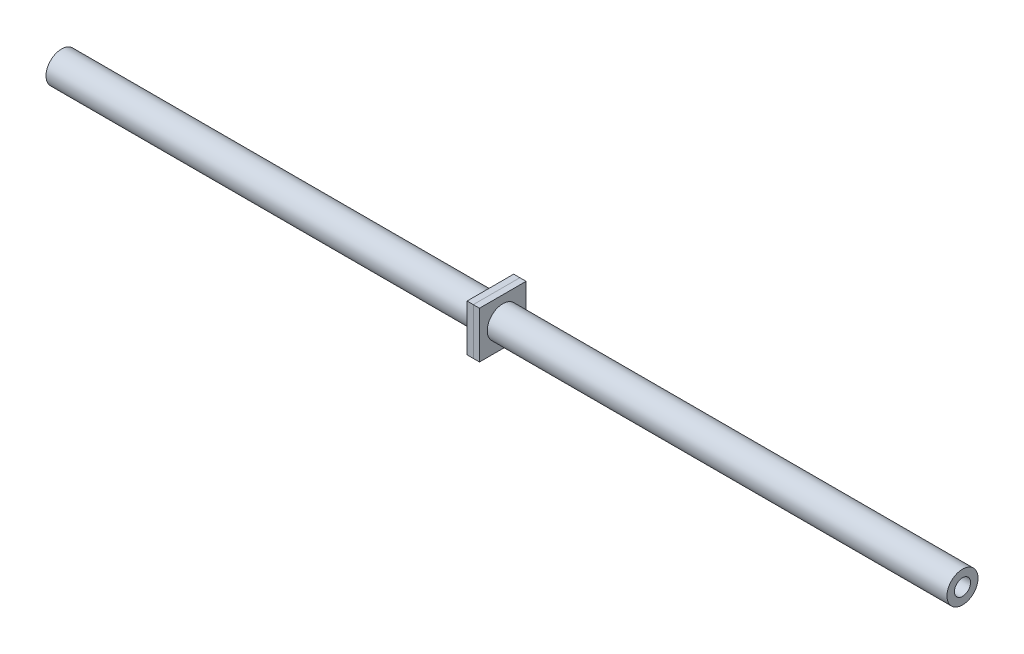
ISO-10303-21;
HEADER;
FILE_DESCRIPTION(('STEP AP214'),'2;1');
FILE_NAME('part.step','',(''),(''),'','','');
FILE_SCHEMA(('AUTOMOTIVE_DESIGN { 1 0 10303 214 1 1 1 1 }'));
ENDSEC;
DATA;
#1=APPLICATION_CONTEXT('core data for automotive mechanical design processes');
#2=APPLICATION_PROTOCOL_DEFINITION('international standard','automotive_design',2000,#1);
#3=PRODUCT_CONTEXT('',#1,'mechanical');
#4=PRODUCT('Part','Part','',(#3));
#5=PRODUCT_RELATED_PRODUCT_CATEGORY('part','',(#4));
#6=PRODUCT_DEFINITION_FORMATION('','',#4);
#7=PRODUCT_DEFINITION_CONTEXT('part definition',#1,'design');
#8=PRODUCT_DEFINITION('design','',#6,#7);
#9=PRODUCT_DEFINITION_SHAPE('','',#8);
#10=(LENGTH_UNIT() NAMED_UNIT(*) SI_UNIT(.MILLI.,.METRE.));
#11=(NAMED_UNIT(*) PLANE_ANGLE_UNIT() SI_UNIT($,.RADIAN.));
#12=(NAMED_UNIT(*) SI_UNIT($,.STERADIAN.) SOLID_ANGLE_UNIT());
#13=UNCERTAINTY_MEASURE_WITH_UNIT(LENGTH_MEASURE(1.E-05),#10,'distance_accuracy_value','');
#14=(GEOMETRIC_REPRESENTATION_CONTEXT(3) GLOBAL_UNCERTAINTY_ASSIGNED_CONTEXT((#13)) GLOBAL_UNIT_ASSIGNED_CONTEXT((#10,
#11,#12)) REPRESENTATION_CONTEXT('',''));
#15=CARTESIAN_POINT('',(0.,0.,0.));
#16=DIRECTION('',(0.,0.,1.));
#17=DIRECTION('',(1.,0.,0.));
#18=AXIS2_PLACEMENT_3D('',#15,#16,#17);
#19=CARTESIAN_POINT('',(175.26,0.,0.));
#20=DIRECTION('',(1.,0.,0.));
#21=DIRECTION('',(0.,0.,-1.));
#22=AXIS2_PLACEMENT_3D('',#19,#20,#21);
#23=PLANE('',#22);
#24=DIRECTION('',(0.,1.,0.));
#25=VECTOR('',#24,1.);
#26=CARTESIAN_POINT('',(175.26,0.,-9.525));
#27=LINE('',#26,#25);
#28=CARTESIAN_POINT('',(175.26,-9.525,-9.525));
#29=VERTEX_POINT('',#28);
#30=CARTESIAN_POINT('',(175.26,9.525,-9.525));
#31=VERTEX_POINT('',#30);
#32=EDGE_CURVE('E114',#29,#31,#27,.T.);
#33=ORIENTED_EDGE('',*,*,#32,.F.);
#34=DIRECTION('',(0.,0.,-1.));
#35=VECTOR('',#34,1.);
#36=CARTESIAN_POINT('',(175.26,-9.525,0.));
#37=LINE('',#36,#35);
#38=CARTESIAN_POINT('',(175.26,-9.525,9.525));
#39=VERTEX_POINT('',#38);
#40=EDGE_CURVE('E111',#39,#29,#37,.T.);
#41=ORIENTED_EDGE('',*,*,#40,.F.);
#42=DIRECTION('',(0.,-1.,0.));
#43=VECTOR('',#42,1.);
#44=CARTESIAN_POINT('',(175.26,0.,9.525));
#45=LINE('',#44,#43);
#46=CARTESIAN_POINT('',(175.26,9.525,9.525));
#47=VERTEX_POINT('',#46);
#48=EDGE_CURVE('E104',#47,#39,#45,.T.);
#49=ORIENTED_EDGE('',*,*,#48,.F.);
#50=DIRECTION('',(0.,0.,1.));
#51=VECTOR('',#50,1.);
#52=CARTESIAN_POINT('',(175.26,9.525,0.));
#53=LINE('',#52,#51);
#54=EDGE_CURVE('E110',#31,#47,#53,.T.);
#55=ORIENTED_EDGE('',*,*,#54,.F.);
#56=EDGE_LOOP('',(#33,#41,#49,#55));
#57=FACE_BOUND('',#56,.T.);
#58=CARTESIAN_POINT('',(175.26,0.,0.));
#59=DIRECTION('',(-1.,0.,0.));
#60=DIRECTION('',(0.,0.,1.));
#61=AXIS2_PLACEMENT_3D('',#58,#59,#60);
#62=CIRCLE('',#61,6.35);
#63=CARTESIAN_POINT('',(175.26,0.,6.35));
#64=VERTEX_POINT('',#63);
#65=EDGE_CURVE('E125',#64,#64,#62,.T.);
#66=ORIENTED_EDGE('',*,*,#65,.F.);
#67=EDGE_LOOP('',(#66));
#68=FACE_BOUND('',#67,.T.);
#69=ADVANCED_FACE('F55',(#57,#68),#23,.F.);
#70=CARTESIAN_POINT('',(177.8,0.,0.));
#71=DIRECTION('',(1.,0.,0.));
#72=DIRECTION('',(0.,0.,-1.));
#73=AXIS2_PLACEMENT_3D('',#70,#71,#72);
#74=PLANE('',#73);
#75=DIRECTION('',(0.,1.,0.));
#76=VECTOR('',#75,1.);
#77=CARTESIAN_POINT('',(177.8,0.,-9.525));
#78=LINE('',#77,#76);
#79=CARTESIAN_POINT('',(177.8,-9.525,-9.525));
#80=VERTEX_POINT('',#79);
#81=CARTESIAN_POINT('',(177.8,9.525,-9.525));
#82=VERTEX_POINT('',#81);
#83=EDGE_CURVE('E121',#80,#82,#78,.T.);
#84=ORIENTED_EDGE('',*,*,#83,.T.);
#85=DIRECTION('',(0.,0.,1.));
#86=VECTOR('',#85,1.);
#87=CARTESIAN_POINT('',(177.8,9.525,0.));
#88=LINE('',#87,#86);
#89=CARTESIAN_POINT('',(177.8,9.525,9.525));
#90=VERTEX_POINT('',#89);
#91=EDGE_CURVE('E124',#82,#90,#88,.T.);
#92=ORIENTED_EDGE('',*,*,#91,.T.);
#93=DIRECTION('',(0.,-1.,0.));
#94=VECTOR('',#93,1.);
#95=CARTESIAN_POINT('',(177.8,0.,9.525));
#96=LINE('',#95,#94);
#97=CARTESIAN_POINT('',(177.8,-9.525,9.525));
#98=VERTEX_POINT('',#97);
#99=EDGE_CURVE('E106',#90,#98,#96,.T.);
#100=ORIENTED_EDGE('',*,*,#99,.T.);
#101=DIRECTION('',(0.,0.,-1.));
#102=VECTOR('',#101,1.);
#103=CARTESIAN_POINT('',(177.8,-9.525,0.));
#104=LINE('',#103,#102);
#105=EDGE_CURVE('E116',#98,#80,#104,.T.);
#106=ORIENTED_EDGE('',*,*,#105,.T.);
#107=EDGE_LOOP('',(#84,#92,#100,#106));
#108=FACE_BOUND('',#107,.T.);
#109=CARTESIAN_POINT('',(177.8,0.,0.));
#110=DIRECTION('',(-1.,0.,0.));
#111=DIRECTION('',(0.,0.,1.));
#112=AXIS2_PLACEMENT_3D('',#109,#110,#111);
#113=CIRCLE('',#112,6.35);
#114=CARTESIAN_POINT('',(177.8,0.,6.35));
#115=VERTEX_POINT('',#114);
#116=EDGE_CURVE('E159',#115,#115,#113,.T.);
#117=ORIENTED_EDGE('',*,*,#116,.T.);
#118=EDGE_LOOP('',(#117));
#119=FACE_BOUND('',#118,.T.);
#120=ADVANCED_FACE('F131',(#108,#119),#74,.T.);
#121=CARTESIAN_POINT('',(175.26,0.,-9.525));
#122=DIRECTION('',(0.,0.,-1.));
#123=DIRECTION('',(0.,1.,0.));
#124=AXIS2_PLACEMENT_3D('',#121,#122,#123);
#125=PLANE('',#124);
#126=ORIENTED_EDGE('',*,*,#83,.F.);
#127=DIRECTION('',(1.,0.,0.));
#128=VECTOR('',#127,1.);
#129=CARTESIAN_POINT('',(175.26,-9.525,-9.525));
#130=LINE('',#129,#128);
#131=EDGE_CURVE('E13',#29,#80,#130,.T.);
#132=ORIENTED_EDGE('',*,*,#131,.F.);
#133=ORIENTED_EDGE('',*,*,#32,.T.);
#134=DIRECTION('',(1.,0.,0.));
#135=VECTOR('',#134,1.);
#136=CARTESIAN_POINT('',(175.26,9.525,-9.525));
#137=LINE('',#136,#135);
#138=EDGE_CURVE('E59',#31,#82,#137,.T.);
#139=ORIENTED_EDGE('',*,*,#138,.T.);
#140=EDGE_LOOP('',(#126,#132,#133,#139));
#141=FACE_BOUND('',#140,.T.);
#142=ADVANCED_FACE('F57',(#141),#125,.T.);
#143=CARTESIAN_POINT('',(175.26,-9.525,0.));
#144=DIRECTION('',(0.,-1.,0.));
#145=DIRECTION('',(0.,0.,-1.));
#146=AXIS2_PLACEMENT_3D('',#143,#144,#145);
#147=PLANE('',#146);
#148=ORIENTED_EDGE('',*,*,#105,.F.);
#149=DIRECTION('',(1.,0.,0.));
#150=VECTOR('',#149,1.);
#151=CARTESIAN_POINT('',(175.26,-9.525,9.525));
#152=LINE('',#151,#150);
#153=EDGE_CURVE('E65',#39,#98,#152,.T.);
#154=ORIENTED_EDGE('',*,*,#153,.F.);
#155=ORIENTED_EDGE('',*,*,#40,.T.);
#156=ORIENTED_EDGE('',*,*,#131,.T.);
#157=EDGE_LOOP('',(#148,#154,#155,#156));
#158=FACE_BOUND('',#157,.T.);
#159=ADVANCED_FACE('F133',(#158),#147,.T.);
#160=CARTESIAN_POINT('',(175.26,0.,9.525));
#161=DIRECTION('',(0.,0.,1.));
#162=DIRECTION('',(0.,-1.,0.));
#163=AXIS2_PLACEMENT_3D('',#160,#161,#162);
#164=PLANE('',#163);
#165=ORIENTED_EDGE('',*,*,#99,.F.);
#166=DIRECTION('',(1.,0.,0.));
#167=VECTOR('',#166,1.);
#168=CARTESIAN_POINT('',(175.26,9.525,9.525));
#169=LINE('',#168,#167);
#170=EDGE_CURVE('E101',#47,#90,#169,.T.);
#171=ORIENTED_EDGE('',*,*,#170,.F.);
#172=ORIENTED_EDGE('',*,*,#48,.T.);
#173=ORIENTED_EDGE('',*,*,#153,.T.);
#174=EDGE_LOOP('',(#165,#171,#172,#173));
#175=FACE_BOUND('',#174,.T.);
#176=ADVANCED_FACE('F103',(#175),#164,.T.);
#177=CARTESIAN_POINT('',(175.26,9.525,0.));
#178=DIRECTION('',(0.,1.,0.));
#179=DIRECTION('',(0.,0.,1.));
#180=AXIS2_PLACEMENT_3D('',#177,#178,#179);
#181=PLANE('',#180);
#182=ORIENTED_EDGE('',*,*,#91,.F.);
#183=ORIENTED_EDGE('',*,*,#138,.F.);
#184=ORIENTED_EDGE('',*,*,#54,.T.);
#185=ORIENTED_EDGE('',*,*,#170,.T.);
#186=EDGE_LOOP('',(#182,#183,#184,#185));
#187=FACE_BOUND('',#186,.T.);
#188=ADVANCED_FACE('F113',(#187),#181,.T.);
#189=CARTESIAN_POINT('',(175.26,0.,0.));
#190=DIRECTION('',(1.,0.,0.));
#191=DIRECTION('',(0.,0.,-1.));
#192=AXIS2_PLACEMENT_3D('',#189,#190,#191);
#193=CYLINDRICAL_SURFACE('',#192,6.35);
#194=ORIENTED_EDGE('',*,*,#65,.T.);
#195=EDGE_LOOP('',(#194));
#196=FACE_BOUND('',#195,.T.);
#197=ORIENTED_EDGE('',*,*,#116,.F.);
#198=EDGE_LOOP('',(#197));
#199=FACE_BOUND('',#198,.T.);
#200=ADVANCED_FACE('F148',(#196,#199),#193,.F.);
#201=CLOSED_SHELL('',(#69,#120,#142,#159,#176,#188,#200));
#202=MANIFOLD_SOLID_BREP('B2',#201);
#203=CARTESIAN_POINT('',(180.34,0.,0.));
#204=DIRECTION('',(-1.,0.,0.));
#205=DIRECTION('',(0.,0.,1.));
#206=AXIS2_PLACEMENT_3D('',#203,#204,#205);
#207=PLANE('',#206);
#208=DIRECTION('',(0.,-1.,0.));
#209=VECTOR('',#208,1.);
#210=CARTESIAN_POINT('',(180.34,9.525,9.525));
#211=LINE('',#210,#209);
#212=CARTESIAN_POINT('',(180.34,9.525,9.525));
#213=VERTEX_POINT('',#212);
#214=CARTESIAN_POINT('',(180.34,-9.525,9.525));
#215=VERTEX_POINT('',#214);
#216=EDGE_CURVE('E259',#213,#215,#211,.T.);
#217=ORIENTED_EDGE('',*,*,#216,.T.);
#218=DIRECTION('',(0.,0.,-1.));
#219=VECTOR('',#218,1.);
#220=CARTESIAN_POINT('',(180.34,-9.525,-9.525));
#221=LINE('',#220,#219);
#222=CARTESIAN_POINT('',(180.34,-9.525,-9.525));
#223=VERTEX_POINT('',#222);
#224=EDGE_CURVE('E254',#215,#223,#221,.T.);
#225=ORIENTED_EDGE('',*,*,#224,.T.);
#226=DIRECTION('',(0.,1.,0.));
#227=VECTOR('',#226,1.);
#228=CARTESIAN_POINT('',(180.34,9.525,-9.525));
#229=LINE('',#228,#227);
#230=CARTESIAN_POINT('',(180.34,9.525,-9.525));
#231=VERTEX_POINT('',#230);
#232=EDGE_CURVE('E257',#223,#231,#229,.T.);
#233=ORIENTED_EDGE('',*,*,#232,.T.);
#234=DIRECTION('',(0.,0.,1.));
#235=VECTOR('',#234,1.);
#236=CARTESIAN_POINT('',(180.34,9.525,-9.525));
#237=LINE('',#236,#235);
#238=EDGE_CURVE('E224',#231,#213,#237,.T.);
#239=ORIENTED_EDGE('',*,*,#238,.T.);
#240=EDGE_LOOP('',(#217,#225,#233,#239));
#241=FACE_BOUND('',#240,.T.);
#242=CARTESIAN_POINT('',(180.34,0.,0.));
#243=DIRECTION('',(1.,0.,0.));
#244=DIRECTION('',(0.,0.,-1.));
#245=AXIS2_PLACEMENT_3D('',#242,#243,#244);
#246=CIRCLE('',#245,6.35);
#247=CARTESIAN_POINT('',(180.34,0.,-6.35));
#248=VERTEX_POINT('',#247);
#249=EDGE_CURVE('E274',#248,#248,#246,.T.);
#250=ORIENTED_EDGE('',*,*,#249,.F.);
#251=EDGE_LOOP('',(#250));
#252=FACE_BOUND('',#251,.T.);
#253=ADVANCED_FACE('F207',(#241,#252),#207,.F.);
#254=CARTESIAN_POINT('',(177.8,0.,0.));
#255=DIRECTION('',(-1.,0.,0.));
#256=DIRECTION('',(0.,0.,1.));
#257=AXIS2_PLACEMENT_3D('',#254,#255,#256);
#258=PLANE('',#257);
#259=DIRECTION('',(0.,-1.,0.));
#260=VECTOR('',#259,1.);
#261=CARTESIAN_POINT('',(177.8,9.525,9.525));
#262=LINE('',#261,#260);
#263=CARTESIAN_POINT('',(177.8,9.525,9.525));
#264=VERTEX_POINT('',#263);
#265=CARTESIAN_POINT('',(177.8,-9.525,9.525));
#266=VERTEX_POINT('',#265);
#267=EDGE_CURVE('E271',#264,#266,#262,.T.);
#268=ORIENTED_EDGE('',*,*,#267,.F.);
#269=DIRECTION('',(0.,0.,1.));
#270=VECTOR('',#269,1.);
#271=CARTESIAN_POINT('',(177.8,9.525,-9.525));
#272=LINE('',#271,#270);
#273=CARTESIAN_POINT('',(177.8,9.525,-9.525));
#274=VERTEX_POINT('',#273);
#275=EDGE_CURVE('E247',#274,#264,#272,.T.);
#276=ORIENTED_EDGE('',*,*,#275,.F.);
#277=DIRECTION('',(0.,1.,0.));
#278=VECTOR('',#277,1.);
#279=CARTESIAN_POINT('',(177.8,9.525,-9.525));
#280=LINE('',#279,#278);
#281=CARTESIAN_POINT('',(177.8,-9.525,-9.525));
#282=VERTEX_POINT('',#281);
#283=EDGE_CURVE('E241',#282,#274,#280,.T.);
#284=ORIENTED_EDGE('',*,*,#283,.F.);
#285=DIRECTION('',(0.,0.,-1.));
#286=VECTOR('',#285,1.);
#287=CARTESIAN_POINT('',(177.8,-9.525,-9.525));
#288=LINE('',#287,#286);
#289=EDGE_CURVE('E263',#266,#282,#288,.T.);
#290=ORIENTED_EDGE('',*,*,#289,.F.);
#291=EDGE_LOOP('',(#268,#276,#284,#290));
#292=FACE_BOUND('',#291,.T.);
#293=CARTESIAN_POINT('',(177.8,0.,0.));
#294=DIRECTION('',(1.,0.,0.));
#295=DIRECTION('',(0.,0.,-1.));
#296=AXIS2_PLACEMENT_3D('',#293,#294,#295);
#297=CIRCLE('',#296,6.35);
#298=CARTESIAN_POINT('',(177.8,0.,-6.35));
#299=VERTEX_POINT('',#298);
#300=EDGE_CURVE('E286',#299,#299,#297,.T.);
#301=ORIENTED_EDGE('',*,*,#300,.T.);
#302=EDGE_LOOP('',(#301));
#303=FACE_BOUND('',#302,.T.);
#304=ADVANCED_FACE('F282',(#292,#303),#258,.T.);
#305=CARTESIAN_POINT('',(180.34,9.525,9.525));
#306=DIRECTION('',(0.,0.,-1.));
#307=DIRECTION('',(0.,1.,0.));
#308=AXIS2_PLACEMENT_3D('',#305,#306,#307);
#309=PLANE('',#308);
#310=ORIENTED_EDGE('',*,*,#267,.T.);
#311=DIRECTION('',(-1.,0.,0.));
#312=VECTOR('',#311,1.);
#313=CARTESIAN_POINT('',(180.34,-9.525,9.525));
#314=LINE('',#313,#312);
#315=EDGE_CURVE('E53',#215,#266,#314,.T.);
#316=ORIENTED_EDGE('',*,*,#315,.F.);
#317=ORIENTED_EDGE('',*,*,#216,.F.);
#318=DIRECTION('',(-1.,0.,0.));
#319=VECTOR('',#318,1.);
#320=CARTESIAN_POINT('',(180.34,9.525,9.525));
#321=LINE('',#320,#319);
#322=EDGE_CURVE('E267',#213,#264,#321,.T.);
#323=ORIENTED_EDGE('',*,*,#322,.T.);
#324=EDGE_LOOP('',(#310,#316,#317,#323));
#325=FACE_BOUND('',#324,.T.);
#326=ADVANCED_FACE('F209',(#325),#309,.F.);
#327=CARTESIAN_POINT('',(180.34,-9.525,-9.525));
#328=DIRECTION('',(0.,1.,0.));
#329=DIRECTION('',(0.,0.,1.));
#330=AXIS2_PLACEMENT_3D('',#327,#328,#329);
#331=PLANE('',#330);
#332=ORIENTED_EDGE('',*,*,#289,.T.);
#333=DIRECTION('',(-1.,0.,0.));
#334=VECTOR('',#333,1.);
#335=CARTESIAN_POINT('',(180.34,-9.525,-9.525));
#336=LINE('',#335,#334);
#337=EDGE_CURVE('E216',#223,#282,#336,.T.);
#338=ORIENTED_EDGE('',*,*,#337,.F.);
#339=ORIENTED_EDGE('',*,*,#224,.F.);
#340=ORIENTED_EDGE('',*,*,#315,.T.);
#341=EDGE_LOOP('',(#332,#338,#339,#340));
#342=FACE_BOUND('',#341,.T.);
#343=ADVANCED_FACE('F262',(#342),#331,.F.);
#344=CARTESIAN_POINT('',(180.34,9.525,-9.525));
#345=DIRECTION('',(0.,0.,1.));
#346=DIRECTION('',(0.,-1.,0.));
#347=AXIS2_PLACEMENT_3D('',#344,#345,#346);
#348=PLANE('',#347);
#349=ORIENTED_EDGE('',*,*,#283,.T.);
#350=DIRECTION('',(-1.,0.,0.));
#351=VECTOR('',#350,1.);
#352=CARTESIAN_POINT('',(180.34,9.525,-9.525));
#353=LINE('',#352,#351);
#354=EDGE_CURVE('E264',#231,#274,#353,.T.);
#355=ORIENTED_EDGE('',*,*,#354,.F.);
#356=ORIENTED_EDGE('',*,*,#232,.F.);
#357=ORIENTED_EDGE('',*,*,#337,.T.);
#358=EDGE_LOOP('',(#349,#355,#356,#357));
#359=FACE_BOUND('',#358,.T.);
#360=ADVANCED_FACE('F265',(#359),#348,.F.);
#361=CARTESIAN_POINT('',(180.34,9.525,-9.525));
#362=DIRECTION('',(0.,-1.,0.));
#363=DIRECTION('',(0.,0.,-1.));
#364=AXIS2_PLACEMENT_3D('',#361,#362,#363);
#365=PLANE('',#364);
#366=ORIENTED_EDGE('',*,*,#275,.T.);
#367=ORIENTED_EDGE('',*,*,#322,.F.);
#368=ORIENTED_EDGE('',*,*,#238,.F.);
#369=ORIENTED_EDGE('',*,*,#354,.T.);
#370=EDGE_LOOP('',(#366,#367,#368,#369));
#371=FACE_BOUND('',#370,.T.);
#372=ADVANCED_FACE('F279',(#371),#365,.F.);
#373=CARTESIAN_POINT('',(180.34,0.,0.));
#374=DIRECTION('',(-1.,0.,0.));
#375=DIRECTION('',(0.,0.,1.));
#376=AXIS2_PLACEMENT_3D('',#373,#374,#375);
#377=CYLINDRICAL_SURFACE('',#376,6.35);
#378=ORIENTED_EDGE('',*,*,#249,.T.);
#379=EDGE_LOOP('',(#378));
#380=FACE_BOUND('',#379,.T.);
#381=ORIENTED_EDGE('',*,*,#300,.F.);
#382=EDGE_LOOP('',(#381));
#383=FACE_BOUND('',#382,.T.);
#384=ADVANCED_FACE('F292',(#380,#383),#377,.F.);
#385=CLOSED_SHELL('',(#253,#304,#326,#343,#360,#372,#384));
#386=MANIFOLD_SOLID_BREP('B7',#385);
#387=CARTESIAN_POINT('',(368.21482491,0.,0.));
#388=DIRECTION('',(-1.,0.,0.));
#389=DIRECTION('',(0.,0.,1.));
#390=AXIS2_PLACEMENT_3D('',#387,#388,#389);
#391=CYLINDRICAL_SURFACE('',#390,3.302);
#392=CARTESIAN_POINT('',(368.21482491,0.,0.));
#393=DIRECTION('',(1.,0.,0.));
#394=DIRECTION('',(0.,0.,-1.));
#395=AXIS2_PLACEMENT_3D('',#392,#393,#394);
#396=CIRCLE('',#395,3.302);
#397=CARTESIAN_POINT('',(368.21482491,0.,3.302));
#398=VERTEX_POINT('',#397);
#399=EDGE_CURVE('E344',#398,#398,#396,.T.);
#400=CARTESIAN_POINT('',(0.,0.,0.));
#401=DIRECTION('',(1.,0.,0.));
#402=DIRECTION('',(0.,0.,-1.));
#403=AXIS2_PLACEMENT_3D('',#400,#401,#402);
#404=CIRCLE('',#403,3.302);
#405=CARTESIAN_POINT('',(0.,0.,3.302));
#406=VERTEX_POINT('',#405);
#407=EDGE_CURVE('E350',#406,#406,#404,.T.);
#408=CARTESIAN_POINT('',(368.21482491,0.,3.302));
#409=CARTESIAN_POINT('',(364.379253817187,0.,3.302));
#410=CARTESIAN_POINT('',(360.543682724375,0.,3.302));
#411=CARTESIAN_POINT('',(352.87254053875,0.,3.302));
#412=CARTESIAN_POINT('',(349.036969445937,0.,3.302));
#413=CARTESIAN_POINT('',(341.365827260312,0.,3.302));
#414=CARTESIAN_POINT('',(337.5302561675,0.,3.302));
#415=CARTESIAN_POINT('',(329.859113981875,0.,3.302));
#416=CARTESIAN_POINT('',(326.023542889062,0.,3.302));
#417=CARTESIAN_POINT('',(318.352400703437,0.,3.302));
#418=CARTESIAN_POINT('',(314.516829610625,0.,3.302));
#419=CARTESIAN_POINT('',(306.845687425,0.,3.302));
#420=CARTESIAN_POINT('',(303.010116332187,0.,3.302));
#421=CARTESIAN_POINT('',(295.338974146562,0.,3.302));
#422=CARTESIAN_POINT('',(291.50340305375,0.,3.302));
#423=CARTESIAN_POINT('',(283.832260868125,0.,3.302));
#424=CARTESIAN_POINT('',(279.996689775312,0.,3.302));
#425=CARTESIAN_POINT('',(272.325547589687,0.,3.302));
#426=CARTESIAN_POINT('',(268.489976496875,0.,3.302));
#427=CARTESIAN_POINT('',(260.81883431125,0.,3.302));
#428=CARTESIAN_POINT('',(256.983263218437,0.,3.302));
#429=CARTESIAN_POINT('',(249.312121032812,0.,3.302));
#430=CARTESIAN_POINT('',(245.47654994,0.,3.302));
#431=CARTESIAN_POINT('',(237.805407754375,0.,3.302));
#432=CARTESIAN_POINT('',(233.969836661562,0.,3.302));
#433=CARTESIAN_POINT('',(226.298694475937,0.,3.302));
#434=CARTESIAN_POINT('',(222.463123383125,0.,3.302));
#435=CARTESIAN_POINT('',(214.7919811975,0.,3.302));
#436=CARTESIAN_POINT('',(210.956410104687,0.,3.302));
#437=CARTESIAN_POINT('',(203.285267919062,0.,3.302));
#438=CARTESIAN_POINT('',(199.44969682625,0.,3.302));
#439=CARTESIAN_POINT('',(191.778554640625,0.,3.302));
#440=CARTESIAN_POINT('',(187.942983547812,0.,3.302));
#441=CARTESIAN_POINT('',(180.271841362188,0.,3.302));
#442=CARTESIAN_POINT('',(176.436270269375,0.,3.302));
#443=CARTESIAN_POINT('',(168.76512808375,0.,3.302));
#444=CARTESIAN_POINT('',(164.929556990937,0.,3.302));
#445=CARTESIAN_POINT('',(157.258414805312,0.,3.302));
#446=CARTESIAN_POINT('',(153.4228437125,0.,3.302));
#447=CARTESIAN_POINT('',(145.751701526875,0.,3.302));
#448=CARTESIAN_POINT('',(141.916130434062,0.,3.302));
#449=CARTESIAN_POINT('',(134.244988248437,0.,3.302));
#450=CARTESIAN_POINT('',(130.409417155625,0.,3.302));
#451=CARTESIAN_POINT('',(122.73827497,0.,3.302));
#452=CARTESIAN_POINT('',(118.902703877187,0.,3.302));
#453=CARTESIAN_POINT('',(111.231561691562,0.,3.302));
#454=CARTESIAN_POINT('',(107.39599059875,0.,3.302));
#455=CARTESIAN_POINT('',(99.724848413125,0.,3.302));
#456=CARTESIAN_POINT('',(95.8892773203125,0.,3.302));
#457=CARTESIAN_POINT('',(88.2181351346875,0.,3.302));
#458=CARTESIAN_POINT('',(84.382564041875,0.,3.302));
#459=CARTESIAN_POINT('',(76.71142185625,0.,3.302));
#460=CARTESIAN_POINT('',(72.8758507634375,0.,3.302));
#461=CARTESIAN_POINT('',(65.2047085778125,0.,3.302));
#462=CARTESIAN_POINT('',(61.369137485,0.,3.302));
#463=CARTESIAN_POINT('',(53.697995299375,0.,3.302));
#464=CARTESIAN_POINT('',(49.8624242065625,0.,3.302));
#465=CARTESIAN_POINT('',(42.1912820209375,0.,3.302));
#466=CARTESIAN_POINT('',(38.355710928125,0.,3.302));
#467=CARTESIAN_POINT('',(30.6845687425,0.,3.302));
#468=CARTESIAN_POINT('',(26.8489976496875,0.,3.302));
#469=CARTESIAN_POINT('',(19.1778554640625,0.,3.302));
#470=CARTESIAN_POINT('',(15.34228437125,0.,3.302));
#471=CARTESIAN_POINT('',(7.671142185625,0.,3.302));
#472=CARTESIAN_POINT('',(3.8355710928125,0.,3.302));
#473=CARTESIAN_POINT('',(0.,0.,3.302));
#474=B_SPLINE_CURVE_WITH_KNOTS('',3,(#408,#409,#410,#411,#412,#413,#414,#415,#416,#417,#418,
#419,#420,#421,#422,#423,#424,#425,#426,#427,#428,#429,#430,#431,#432,#433,#434,#435,#436,#437,
#438,#439,#440,#441,#442,#443,#444,#445,#446,#447,#448,#449,#450,#451,#452,#453,#454,#455,#456,
#457,#458,#459,#460,#461,#462,#463,#464,#465,#466,#467,#468,#469,#470,#471,#472,#473),
.UNSPECIFIED.,.F.,.F.,(4,2,2,2,2,2,2,2,2,2,2,2,2,2,2,2,2,2,2,2,2,2,2,2,2,2,2,2,2,2,2,2,4),(0.,
11.5067132784374,23.013426556875,34.5201398353124,46.02685311375,57.5335663921874,
69.040279670625,80.5469929490624,92.0537062275,103.560419505937,115.067132784375,
126.573846062812,138.08055934125,149.587272619687,161.093985898125,172.600699176562,
184.107412455,195.614125733437,207.120839011875,218.627552290312,230.13426556875,
241.640978847187,253.147692125625,264.654405404062,276.1611186825,287.667831960937,
299.174545239375,310.681258517812,322.18797179625,333.694685074687,345.201398353125,
356.708111631562,368.21482491),.UNSPECIFIED.);
#475=EDGE_CURVE('BSEAM337',#398,#406,#474,.T.);
#476=ORIENTED_EDGE('',*,*,#399,.T.);
#477=ORIENTED_EDGE('',*,*,#407,.F.);
#478=ORIENTED_EDGE('',*,*,#475,.T.);
#479=ORIENTED_EDGE('',*,*,#475,.F.);
#480=EDGE_LOOP('',(#476,#478,#477,#479));
#481=FACE_BOUND('',#480,.T.);
#482=ADVANCED_FACE('F337',(#481),#391,.F.);
#483=CARTESIAN_POINT('',(368.21482491,0.,0.));
#484=DIRECTION('',(-1.,0.,0.));
#485=DIRECTION('',(0.,0.,1.));
#486=AXIS2_PLACEMENT_3D('',#483,#484,#485);
#487=CYLINDRICAL_SURFACE('',#486,6.35);
#488=CARTESIAN_POINT('',(368.21482491,0.,0.));
#489=DIRECTION('',(1.,0.,0.));
#490=DIRECTION('',(0.,0.,-1.));
#491=AXIS2_PLACEMENT_3D('',#488,#489,#490);
#492=CIRCLE('',#491,6.35);
#493=CARTESIAN_POINT('',(368.21482491,0.,6.35));
#494=VERTEX_POINT('',#493);
#495=EDGE_CURVE('E206',#494,#494,#492,.T.);
#496=CARTESIAN_POINT('',(0.,0.,0.));
#497=DIRECTION('',(1.,0.,0.));
#498=DIRECTION('',(0.,0.,-1.));
#499=AXIS2_PLACEMENT_3D('',#496,#497,#498);
#500=CIRCLE('',#499,6.35);
#501=CARTESIAN_POINT('',(0.,0.,6.35));
#502=VERTEX_POINT('',#501);
#503=EDGE_CURVE('E340',#502,#502,#500,.T.);
#504=CARTESIAN_POINT('',(368.21482491,0.,6.35));
#505=CARTESIAN_POINT('',(364.379253817187,0.,6.35));
#506=CARTESIAN_POINT('',(360.543682724375,0.,6.35));
#507=CARTESIAN_POINT('',(352.87254053875,0.,6.35));
#508=CARTESIAN_POINT('',(349.036969445937,0.,6.35));
#509=CARTESIAN_POINT('',(341.365827260312,0.,6.35));
#510=CARTESIAN_POINT('',(337.5302561675,0.,6.35));
#511=CARTESIAN_POINT('',(329.859113981875,0.,6.35));
#512=CARTESIAN_POINT('',(326.023542889062,0.,6.35));
#513=CARTESIAN_POINT('',(318.352400703437,0.,6.35));
#514=CARTESIAN_POINT('',(314.516829610625,0.,6.35));
#515=CARTESIAN_POINT('',(306.845687425,0.,6.35));
#516=CARTESIAN_POINT('',(303.010116332187,0.,6.35));
#517=CARTESIAN_POINT('',(295.338974146562,0.,6.35));
#518=CARTESIAN_POINT('',(291.50340305375,0.,6.35));
#519=CARTESIAN_POINT('',(283.832260868125,0.,6.35));
#520=CARTESIAN_POINT('',(279.996689775312,0.,6.35));
#521=CARTESIAN_POINT('',(272.325547589687,0.,6.35));
#522=CARTESIAN_POINT('',(268.489976496875,0.,6.35));
#523=CARTESIAN_POINT('',(260.81883431125,0.,6.35));
#524=CARTESIAN_POINT('',(256.983263218437,0.,6.35));
#525=CARTESIAN_POINT('',(249.312121032812,0.,6.35));
#526=CARTESIAN_POINT('',(245.47654994,0.,6.35));
#527=CARTESIAN_POINT('',(237.805407754375,0.,6.35));
#528=CARTESIAN_POINT('',(233.969836661562,0.,6.35));
#529=CARTESIAN_POINT('',(226.298694475937,0.,6.35));
#530=CARTESIAN_POINT('',(222.463123383125,0.,6.35));
#531=CARTESIAN_POINT('',(214.7919811975,0.,6.35));
#532=CARTESIAN_POINT('',(210.956410104687,0.,6.35));
#533=CARTESIAN_POINT('',(203.285267919062,0.,6.35));
#534=CARTESIAN_POINT('',(199.44969682625,0.,6.35));
#535=CARTESIAN_POINT('',(191.778554640625,0.,6.35));
#536=CARTESIAN_POINT('',(187.942983547812,0.,6.35));
#537=CARTESIAN_POINT('',(180.271841362188,0.,6.35));
#538=CARTESIAN_POINT('',(176.436270269375,0.,6.35));
#539=CARTESIAN_POINT('',(168.76512808375,0.,6.35));
#540=CARTESIAN_POINT('',(164.929556990937,0.,6.35));
#541=CARTESIAN_POINT('',(157.258414805312,0.,6.35));
#542=CARTESIAN_POINT('',(153.4228437125,0.,6.35));
#543=CARTESIAN_POINT('',(145.751701526875,0.,6.35));
#544=CARTESIAN_POINT('',(141.916130434062,0.,6.35));
#545=CARTESIAN_POINT('',(134.244988248437,0.,6.35));
#546=CARTESIAN_POINT('',(130.409417155625,0.,6.35));
#547=CARTESIAN_POINT('',(122.73827497,0.,6.35));
#548=CARTESIAN_POINT('',(118.902703877187,0.,6.35));
#549=CARTESIAN_POINT('',(111.231561691562,0.,6.35));
#550=CARTESIAN_POINT('',(107.39599059875,0.,6.35));
#551=CARTESIAN_POINT('',(99.724848413125,0.,6.35));
#552=CARTESIAN_POINT('',(95.8892773203125,0.,6.35));
#553=CARTESIAN_POINT('',(88.2181351346875,0.,6.35));
#554=CARTESIAN_POINT('',(84.382564041875,0.,6.35));
#555=CARTESIAN_POINT('',(76.71142185625,0.,6.35));
#556=CARTESIAN_POINT('',(72.8758507634375,0.,6.35));
#557=CARTESIAN_POINT('',(65.2047085778125,0.,6.35));
#558=CARTESIAN_POINT('',(61.369137485,0.,6.35));
#559=CARTESIAN_POINT('',(53.697995299375,0.,6.35));
#560=CARTESIAN_POINT('',(49.8624242065625,0.,6.35));
#561=CARTESIAN_POINT('',(42.1912820209375,0.,6.35));
#562=CARTESIAN_POINT('',(38.355710928125,0.,6.35));
#563=CARTESIAN_POINT('',(30.6845687425,0.,6.35));
#564=CARTESIAN_POINT('',(26.8489976496875,0.,6.35));
#565=CARTESIAN_POINT('',(19.1778554640625,0.,6.35));
#566=CARTESIAN_POINT('',(15.34228437125,0.,6.35));
#567=CARTESIAN_POINT('',(7.671142185625,0.,6.35));
#568=CARTESIAN_POINT('',(3.8355710928125,0.,6.35));
#569=CARTESIAN_POINT('',(0.,0.,6.35));
#570=B_SPLINE_CURVE_WITH_KNOTS('',3,(#504,#505,#506,#507,#508,#509,#510,#511,#512,#513,#514,
#515,#516,#517,#518,#519,#520,#521,#522,#523,#524,#525,#526,#527,#528,#529,#530,#531,#532,#533,
#534,#535,#536,#537,#538,#539,#540,#541,#542,#543,#544,#545,#546,#547,#548,#549,#550,#551,#552,
#553,#554,#555,#556,#557,#558,#559,#560,#561,#562,#563,#564,#565,#566,#567,#568,#569),
.UNSPECIFIED.,.F.,.F.,(4,2,2,2,2,2,2,2,2,2,2,2,2,2,2,2,2,2,2,2,2,2,2,2,2,2,2,2,2,2,2,2,4),(0.,
11.5067132784374,23.013426556875,34.5201398353124,46.02685311375,57.5335663921874,
69.040279670625,80.5469929490624,92.0537062275,103.560419505937,115.067132784375,
126.573846062812,138.08055934125,149.587272619687,161.093985898125,172.600699176562,
184.107412455,195.614125733437,207.120839011875,218.627552290312,230.13426556875,
241.640978847187,253.147692125625,264.654405404062,276.1611186825,287.667831960937,
299.174545239375,310.681258517812,322.18797179625,333.694685074687,345.201398353125,
356.708111631562,368.21482491),.UNSPECIFIED.);
#571=EDGE_CURVE('BSEAM357',#494,#502,#570,.T.);
#572=ORIENTED_EDGE('',*,*,#495,.F.);
#573=ORIENTED_EDGE('',*,*,#503,.T.);
#574=ORIENTED_EDGE('',*,*,#571,.T.);
#575=ORIENTED_EDGE('',*,*,#571,.F.);
#576=EDGE_LOOP('',(#572,#574,#573,#575));
#577=FACE_BOUND('',#576,.T.);
#578=ADVANCED_FACE('F357',(#577),#487,.T.);
#579=CARTESIAN_POINT('',(368.21482491,0.,0.));
#580=DIRECTION('',(1.,0.,0.));
#581=DIRECTION('',(0.,0.,-1.));
#582=AXIS2_PLACEMENT_3D('',#579,#580,#581);
#583=PLANE('',#582);
#584=ORIENTED_EDGE('',*,*,#399,.F.);
#585=EDGE_LOOP('',(#584));
#586=FACE_BOUND('',#585,.T.);
#587=ORIENTED_EDGE('',*,*,#495,.T.);
#588=EDGE_LOOP('',(#587));
#589=FACE_BOUND('',#588,.T.);
#590=ADVANCED_FACE('F361',(#586,#589),#583,.T.);
#591=CARTESIAN_POINT('',(0.,0.,0.));
#592=DIRECTION('',(1.,0.,0.));
#593=DIRECTION('',(0.,0.,-1.));
#594=AXIS2_PLACEMENT_3D('',#591,#592,#593);
#595=PLANE('',#594);
#596=ORIENTED_EDGE('',*,*,#407,.T.);
#597=EDGE_LOOP('',(#596));
#598=FACE_BOUND('',#597,.T.);
#599=ORIENTED_EDGE('',*,*,#503,.F.);
#600=EDGE_LOOP('',(#599));
#601=FACE_BOUND('',#600,.T.);
#602=ADVANCED_FACE('F359',(#598,#601),#595,.F.);
#603=CLOSED_SHELL('',(#482,#578,#590,#602));
#604=MANIFOLD_SOLID_BREP('B47',#603);
#605=ADVANCED_BREP_SHAPE_REPRESENTATION('',(#18,#202,#386,#604),#14);
#606=SHAPE_DEFINITION_REPRESENTATION(#9,#605);
ENDSEC;
END-ISO-10303-21;
